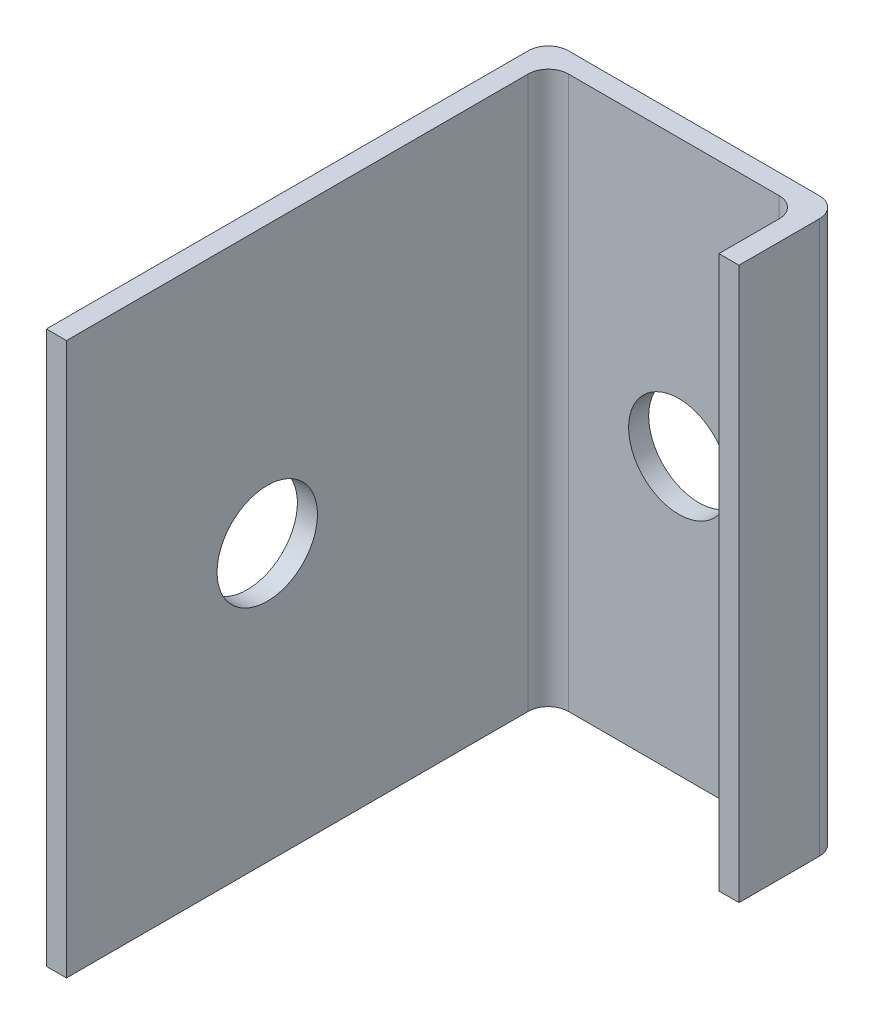
ISO-10303-21;
HEADER;
FILE_DESCRIPTION(('STEP AP214'),'2;1');
FILE_NAME('part.step','',(''),(''),'','','');
FILE_SCHEMA(('AUTOMOTIVE_DESIGN { 1 0 10303 214 1 1 1 1 }'));
ENDSEC;
DATA;
#1=APPLICATION_CONTEXT('core data for automotive mechanical design processes');
#2=APPLICATION_PROTOCOL_DEFINITION('international standard','automotive_design',2000,#1);
#3=PRODUCT_CONTEXT('',#1,'mechanical');
#4=PRODUCT('Part','Part','',(#3));
#5=PRODUCT_RELATED_PRODUCT_CATEGORY('part','',(#4));
#6=PRODUCT_DEFINITION_FORMATION('','',#4);
#7=PRODUCT_DEFINITION_CONTEXT('part definition',#1,'design');
#8=PRODUCT_DEFINITION('design','',#6,#7);
#9=PRODUCT_DEFINITION_SHAPE('','',#8);
#10=(LENGTH_UNIT() NAMED_UNIT(*) SI_UNIT(.MILLI.,.METRE.));
#11=(NAMED_UNIT(*) PLANE_ANGLE_UNIT() SI_UNIT($,.RADIAN.));
#12=(NAMED_UNIT(*) SI_UNIT($,.STERADIAN.) SOLID_ANGLE_UNIT());
#13=UNCERTAINTY_MEASURE_WITH_UNIT(LENGTH_MEASURE(1.E-05),#10,'distance_accuracy_value','');
#14=(GEOMETRIC_REPRESENTATION_CONTEXT(3) GLOBAL_UNCERTAINTY_ASSIGNED_CONTEXT((#13)) GLOBAL_UNIT_ASSIGNED_CONTEXT((#10,
#11,#12)) REPRESENTATION_CONTEXT('',''));
#15=CARTESIAN_POINT('',(0.,0.,0.));
#16=DIRECTION('',(0.,0.,1.));
#17=DIRECTION('',(1.,0.,0.));
#18=AXIS2_PLACEMENT_3D('',#15,#16,#17);
#19=CARTESIAN_POINT('',(-61.1613974505327,55.,27.487824391172));
#20=DIRECTION('',(0.,0.,-1.));
#21=DIRECTION('',(-1.,0.,0.));
#22=AXIS2_PLACEMENT_3D('',#19,#20,#21);
#23=PLANE('',#22);
#24=DIRECTION('',(1.,0.,0.));
#25=VECTOR('',#24,1.);
#26=CARTESIAN_POINT('',(-61.1613974505327,0.,27.487824391172));
#27=LINE('',#26,#25);
#28=CARTESIAN_POINT('',(-61.1613974505327,0.,27.487824391172));
#29=VERTEX_POINT('',#28);
#30=CARTESIAN_POINT('',(-59.1613974505327,0.,27.487824391172));
#31=VERTEX_POINT('',#30);
#32=EDGE_CURVE('E153',#29,#31,#27,.T.);
#33=ORIENTED_EDGE('',*,*,#32,.T.);
#34=DIRECTION('',(0.,-1.,0.));
#35=VECTOR('',#34,1.);
#36=CARTESIAN_POINT('',(-59.1613974505327,55.,27.487824391172));
#37=LINE('',#36,#35);
#38=CARTESIAN_POINT('',(-59.1613974505327,55.,27.487824391172));
#39=VERTEX_POINT('',#38);
#40=EDGE_CURVE('E11',#39,#31,#37,.T.);
#41=ORIENTED_EDGE('',*,*,#40,.F.);
#42=DIRECTION('',(1.,0.,0.));
#43=VECTOR('',#42,1.);
#44=CARTESIAN_POINT('',(-61.1613974505327,55.,27.487824391172));
#45=LINE('',#44,#43);
#46=CARTESIAN_POINT('',(-61.1613974505327,55.,27.487824391172));
#47=VERTEX_POINT('',#46);
#48=EDGE_CURVE('E176',#47,#39,#45,.T.);
#49=ORIENTED_EDGE('',*,*,#48,.F.);
#50=DIRECTION('',(0.,-1.,0.));
#51=VECTOR('',#50,1.);
#52=CARTESIAN_POINT('',(-61.1613974505327,55.,27.487824391172));
#53=LINE('',#52,#51);
#54=EDGE_CURVE('E149',#47,#29,#53,.T.);
#55=ORIENTED_EDGE('',*,*,#54,.T.);
#56=EDGE_LOOP('',(#33,#41,#49,#55));
#57=FACE_BOUND('',#56,.T.);
#58=ADVANCED_FACE('F33',(#57),#23,.F.);
#59=CARTESIAN_POINT('',(-59.1613974505327,55.,27.487824391172));
#60=DIRECTION('',(-1.,0.,0.));
#61=DIRECTION('',(0.,0.,1.));
#62=AXIS2_PLACEMENT_3D('',#59,#60,#61);
#63=PLANE('',#62);
#64=CARTESIAN_POINT('',(-59.1613974505327,27.5,7.48782439117199));
#65=DIRECTION('',(-1.,0.,0.));
#66=DIRECTION('',(0.,0.,1.));
#67=AXIS2_PLACEMENT_3D('',#64,#65,#66);
#68=CIRCLE('',#67,5.);
#69=CARTESIAN_POINT('',(-59.1613974505327,27.5,12.487824391172));
#70=VERTEX_POINT('',#69);
#71=EDGE_CURVE('E292',#70,#70,#68,.T.);
#72=ORIENTED_EDGE('',*,*,#71,.T.);
#73=EDGE_LOOP('',(#72));
#74=FACE_BOUND('',#73,.T.);
#75=DIRECTION('',(0.,0.,-1.));
#76=VECTOR('',#75,1.);
#77=CARTESIAN_POINT('',(-59.1613974505327,0.,27.487824391172));
#78=LINE('',#77,#76);
#79=CARTESIAN_POINT('',(-59.1613974505327,0.,-18.512175608828));
#80=VERTEX_POINT('',#79);
#81=EDGE_CURVE('E156',#31,#80,#78,.T.);
#82=ORIENTED_EDGE('',*,*,#81,.T.);
#83=DIRECTION('',(0.,-1.,0.));
#84=VECTOR('',#83,1.);
#85=CARTESIAN_POINT('',(-59.1613974505327,55.,-18.512175608828));
#86=LINE('',#85,#84);
#87=CARTESIAN_POINT('',(-59.1613974505327,55.,-18.512175608828));
#88=VERTEX_POINT('',#87);
#89=EDGE_CURVE('E41',#88,#80,#86,.T.);
#90=ORIENTED_EDGE('',*,*,#89,.F.);
#91=DIRECTION('',(0.,0.,-1.));
#92=VECTOR('',#91,1.);
#93=CARTESIAN_POINT('',(-59.1613974505327,55.,27.487824391172));
#94=LINE('',#93,#92);
#95=EDGE_CURVE('E104',#39,#88,#94,.T.);
#96=ORIENTED_EDGE('',*,*,#95,.F.);
#97=ORIENTED_EDGE('',*,*,#40,.T.);
#98=EDGE_LOOP('',(#82,#90,#96,#97));
#99=FACE_BOUND('',#98,.T.);
#100=ADVANCED_FACE('F256',(#74,#99),#63,.F.);
#101=CARTESIAN_POINT('',(-57.1613974505327,55.,-18.512175608828));
#102=DIRECTION('',(0.,-1.,0.));
#103=DIRECTION('',(0.,0.,-1.));
#104=AXIS2_PLACEMENT_3D('',#101,#102,#103);
#105=CYLINDRICAL_SURFACE('',#104,2.);
#106=CARTESIAN_POINT('',(-57.1613974505327,0.,-18.512175608828));
#107=DIRECTION('',(0.,-1.,0.));
#108=DIRECTION('',(0.,0.,1.));
#109=AXIS2_PLACEMENT_3D('',#106,#107,#108);
#110=CIRCLE('',#109,2.);
#111=CARTESIAN_POINT('',(-57.1613974505327,0.,-20.512175608828));
#112=VERTEX_POINT('',#111);
#113=EDGE_CURVE('E159',#80,#112,#110,.T.);
#114=ORIENTED_EDGE('',*,*,#113,.T.);
#115=DIRECTION('',(0.,-1.,0.));
#116=VECTOR('',#115,1.);
#117=CARTESIAN_POINT('',(-57.1613974505327,55.,-20.512175608828));
#118=LINE('',#117,#116);
#119=CARTESIAN_POINT('',(-57.1613974505327,55.,-20.512175608828));
#120=VERTEX_POINT('',#119);
#121=EDGE_CURVE('E195',#120,#112,#118,.T.);
#122=ORIENTED_EDGE('',*,*,#121,.F.);
#123=CARTESIAN_POINT('',(-57.1613974505327,55.,-18.512175608828));
#124=DIRECTION('',(0.,-1.,0.));
#125=DIRECTION('',(0.,0.,1.));
#126=AXIS2_PLACEMENT_3D('',#123,#124,#125);
#127=CIRCLE('',#126,2.);
#128=EDGE_CURVE('E203',#88,#120,#127,.T.);
#129=ORIENTED_EDGE('',*,*,#128,.F.);
#130=ORIENTED_EDGE('',*,*,#89,.T.);
#131=EDGE_LOOP('',(#114,#122,#129,#130));
#132=FACE_BOUND('',#131,.T.);
#133=ADVANCED_FACE('F201',(#132),#105,.F.);
#134=CARTESIAN_POINT('',(-57.1613974505327,55.,-20.512175608828));
#135=DIRECTION('',(0.,0.,-1.));
#136=DIRECTION('',(-1.,0.,0.));
#137=AXIS2_PLACEMENT_3D('',#134,#135,#136);
#138=PLANE('',#137);
#139=CARTESIAN_POINT('',(-46.1613974505327,27.5,-20.512175608828));
#140=DIRECTION('',(0.,0.,-1.));
#141=DIRECTION('',(-1.,0.,0.));
#142=AXIS2_PLACEMENT_3D('',#139,#140,#141);
#143=CIRCLE('',#142,4.99999999999999);
#144=CARTESIAN_POINT('',(-51.1613974505327,27.5,-20.512175608828));
#145=VERTEX_POINT('',#144);
#146=EDGE_CURVE('E157',#145,#145,#143,.T.);
#147=ORIENTED_EDGE('',*,*,#146,.T.);
#148=EDGE_LOOP('',(#147));
#149=FACE_BOUND('',#148,.T.);
#150=DIRECTION('',(1.,0.,0.));
#151=VECTOR('',#150,1.);
#152=CARTESIAN_POINT('',(-57.1613974505327,0.,-20.512175608828));
#153=LINE('',#152,#151);
#154=CARTESIAN_POINT('',(-36.1613974505327,0.,-20.512175608828));
#155=VERTEX_POINT('',#154);
#156=EDGE_CURVE('E161',#112,#155,#153,.T.);
#157=ORIENTED_EDGE('',*,*,#156,.T.);
#158=DIRECTION('',(0.,-1.,0.));
#159=VECTOR('',#158,1.);
#160=CARTESIAN_POINT('',(-36.1613974505327,55.,-20.512175608828));
#161=LINE('',#160,#159);
#162=CARTESIAN_POINT('',(-36.1613974505327,55.,-20.512175608828));
#163=VERTEX_POINT('',#162);
#164=EDGE_CURVE('E192',#163,#155,#161,.T.);
#165=ORIENTED_EDGE('',*,*,#164,.F.);
#166=DIRECTION('',(1.,0.,0.));
#167=VECTOR('',#166,1.);
#168=CARTESIAN_POINT('',(-57.1613974505327,55.,-20.512175608828));
#169=LINE('',#168,#167);
#170=EDGE_CURVE('E221',#120,#163,#169,.T.);
#171=ORIENTED_EDGE('',*,*,#170,.F.);
#172=ORIENTED_EDGE('',*,*,#121,.T.);
#173=EDGE_LOOP('',(#157,#165,#171,#172));
#174=FACE_BOUND('',#173,.T.);
#175=ADVANCED_FACE('F212',(#149,#174),#138,.F.);
#176=CARTESIAN_POINT('',(-36.1613974505327,55.,-18.512175608828));
#177=DIRECTION('',(0.,-1.,0.));
#178=DIRECTION('',(0.,0.,-1.));
#179=AXIS2_PLACEMENT_3D('',#176,#177,#178);
#180=CYLINDRICAL_SURFACE('',#179,2.);
#181=CARTESIAN_POINT('',(-36.1613974505327,0.,-18.512175608828));
#182=DIRECTION('',(0.,-1.,0.));
#183=DIRECTION('',(0.,0.,-1.));
#184=AXIS2_PLACEMENT_3D('',#181,#182,#183);
#185=CIRCLE('',#184,2.);
#186=CARTESIAN_POINT('',(-34.1613974505327,0.,-18.512175608828));
#187=VERTEX_POINT('',#186);
#188=EDGE_CURVE('E163',#155,#187,#185,.T.);
#189=ORIENTED_EDGE('',*,*,#188,.T.);
#190=DIRECTION('',(0.,-1.,0.));
#191=VECTOR('',#190,1.);
#192=CARTESIAN_POINT('',(-34.1613974505327,55.,-18.512175608828));
#193=LINE('',#192,#191);
#194=CARTESIAN_POINT('',(-34.1613974505327,55.,-18.512175608828));
#195=VERTEX_POINT('',#194);
#196=EDGE_CURVE('E189',#195,#187,#193,.T.);
#197=ORIENTED_EDGE('',*,*,#196,.F.);
#198=CARTESIAN_POINT('',(-36.1613974505327,55.,-18.512175608828));
#199=DIRECTION('',(0.,-1.,0.));
#200=DIRECTION('',(0.,0.,-1.));
#201=AXIS2_PLACEMENT_3D('',#198,#199,#200);
#202=CIRCLE('',#201,2.);
#203=EDGE_CURVE('E218',#163,#195,#202,.T.);
#204=ORIENTED_EDGE('',*,*,#203,.F.);
#205=ORIENTED_EDGE('',*,*,#164,.T.);
#206=EDGE_LOOP('',(#189,#197,#204,#205));
#207=FACE_BOUND('',#206,.T.);
#208=ADVANCED_FACE('F216',(#207),#180,.F.);
#209=CARTESIAN_POINT('',(-34.1613974505327,55.,-18.512175608828));
#210=DIRECTION('',(1.,0.,0.));
#211=DIRECTION('',(0.,0.,-1.));
#212=AXIS2_PLACEMENT_3D('',#209,#210,#211);
#213=PLANE('',#212);
#214=DIRECTION('',(0.,0.,1.));
#215=VECTOR('',#214,1.);
#216=CARTESIAN_POINT('',(-34.1613974505327,0.,-18.512175608828));
#217=LINE('',#216,#215);
#218=CARTESIAN_POINT('',(-34.1613974505327,0.,-12.512175608828));
#219=VERTEX_POINT('',#218);
#220=EDGE_CURVE('E165',#187,#219,#217,.T.);
#221=ORIENTED_EDGE('',*,*,#220,.T.);
#222=DIRECTION('',(0.,-1.,0.));
#223=VECTOR('',#222,1.);
#224=CARTESIAN_POINT('',(-34.1613974505327,55.,-12.512175608828));
#225=LINE('',#224,#223);
#226=CARTESIAN_POINT('',(-34.1613974505327,55.,-12.512175608828));
#227=VERTEX_POINT('',#226);
#228=EDGE_CURVE('E186',#227,#219,#225,.T.);
#229=ORIENTED_EDGE('',*,*,#228,.F.);
#230=DIRECTION('',(0.,0.,1.));
#231=VECTOR('',#230,1.);
#232=CARTESIAN_POINT('',(-34.1613974505327,55.,-18.512175608828));
#233=LINE('',#232,#231);
#234=EDGE_CURVE('E220',#195,#227,#233,.T.);
#235=ORIENTED_EDGE('',*,*,#234,.F.);
#236=ORIENTED_EDGE('',*,*,#196,.T.);
#237=EDGE_LOOP('',(#221,#229,#235,#236));
#238=FACE_BOUND('',#237,.T.);
#239=ADVANCED_FACE('F272',(#238),#213,.F.);
#240=CARTESIAN_POINT('',(-34.1613974505327,55.,-12.512175608828));
#241=DIRECTION('',(0.,0.,-1.));
#242=DIRECTION('',(-1.,0.,0.));
#243=AXIS2_PLACEMENT_3D('',#240,#241,#242);
#244=PLANE('',#243);
#245=DIRECTION('',(1.,0.,0.));
#246=VECTOR('',#245,1.);
#247=CARTESIAN_POINT('',(-34.1613974505327,0.,-12.512175608828));
#248=LINE('',#247,#246);
#249=CARTESIAN_POINT('',(-32.1613974505327,0.,-12.512175608828));
#250=VERTEX_POINT('',#249);
#251=EDGE_CURVE('E167',#219,#250,#248,.T.);
#252=ORIENTED_EDGE('',*,*,#251,.T.);
#253=DIRECTION('',(0.,-1.,0.));
#254=VECTOR('',#253,1.);
#255=CARTESIAN_POINT('',(-32.1613974505327,55.,-12.512175608828));
#256=LINE('',#255,#254);
#257=CARTESIAN_POINT('',(-32.1613974505327,55.,-12.512175608828));
#258=VERTEX_POINT('',#257);
#259=EDGE_CURVE('E183',#258,#250,#256,.T.);
#260=ORIENTED_EDGE('',*,*,#259,.F.);
#261=DIRECTION('',(1.,0.,0.));
#262=VECTOR('',#261,1.);
#263=CARTESIAN_POINT('',(-34.1613974505327,55.,-12.512175608828));
#264=LINE('',#263,#262);
#265=EDGE_CURVE('E223',#227,#258,#264,.T.);
#266=ORIENTED_EDGE('',*,*,#265,.F.);
#267=ORIENTED_EDGE('',*,*,#228,.T.);
#268=EDGE_LOOP('',(#252,#260,#266,#267));
#269=FACE_BOUND('',#268,.T.);
#270=ADVANCED_FACE('F275',(#269),#244,.F.);
#271=CARTESIAN_POINT('',(-32.1613974505327,55.,-20.512175608828));
#272=DIRECTION('',(-1.,0.,0.));
#273=DIRECTION('',(0.,0.,1.));
#274=AXIS2_PLACEMENT_3D('',#271,#272,#273);
#275=PLANE('',#274);
#276=DIRECTION('',(0.,0.,-1.));
#277=VECTOR('',#276,1.);
#278=CARTESIAN_POINT('',(-32.1613974505327,0.,-20.512175608828));
#279=LINE('',#278,#277);
#280=CARTESIAN_POINT('',(-32.1613974505327,0.,-20.512175608828));
#281=VERTEX_POINT('',#280);
#282=EDGE_CURVE('E169',#250,#281,#279,.T.);
#283=ORIENTED_EDGE('',*,*,#282,.T.);
#284=DIRECTION('',(0.,-1.,0.));
#285=VECTOR('',#284,1.);
#286=CARTESIAN_POINT('',(-32.1613974505327,55.,-20.512175608828));
#287=LINE('',#286,#285);
#288=CARTESIAN_POINT('',(-32.1613974505327,55.,-20.512175608828));
#289=VERTEX_POINT('',#288);
#290=EDGE_CURVE('E180',#289,#281,#287,.T.);
#291=ORIENTED_EDGE('',*,*,#290,.F.);
#292=DIRECTION('',(0.,0.,-1.));
#293=VECTOR('',#292,1.);
#294=CARTESIAN_POINT('',(-32.1613974505327,55.,-20.512175608828));
#295=LINE('',#294,#293);
#296=EDGE_CURVE('E229',#258,#289,#295,.T.);
#297=ORIENTED_EDGE('',*,*,#296,.F.);
#298=ORIENTED_EDGE('',*,*,#259,.T.);
#299=EDGE_LOOP('',(#283,#291,#297,#298));
#300=FACE_BOUND('',#299,.T.);
#301=ADVANCED_FACE('F235',(#300),#275,.F.);
#302=CARTESIAN_POINT('',(-34.1613974505327,55.,-20.512175608828));
#303=DIRECTION('',(0.,-1.,0.));
#304=DIRECTION('',(0.,0.,-1.));
#305=AXIS2_PLACEMENT_3D('',#302,#303,#304);
#306=CYLINDRICAL_SURFACE('',#305,2.);
#307=CARTESIAN_POINT('',(-34.1613974505327,0.,-20.512175608828));
#308=DIRECTION('',(0.,1.,0.));
#309=DIRECTION('',(0.,0.,1.));
#310=AXIS2_PLACEMENT_3D('',#307,#308,#309);
#311=CIRCLE('',#310,2.);
#312=CARTESIAN_POINT('',(-34.1613974505327,0.,-22.512175608828));
#313=VERTEX_POINT('',#312);
#314=EDGE_CURVE('E171',#281,#313,#311,.T.);
#315=ORIENTED_EDGE('',*,*,#314,.T.);
#316=DIRECTION('',(0.,-1.,0.));
#317=VECTOR('',#316,1.);
#318=CARTESIAN_POINT('',(-34.1613974505327,55.,-22.512175608828));
#319=LINE('',#318,#317);
#320=CARTESIAN_POINT('',(-34.1613974505327,55.,-22.512175608828));
#321=VERTEX_POINT('',#320);
#322=EDGE_CURVE('E144',#321,#313,#319,.T.);
#323=ORIENTED_EDGE('',*,*,#322,.F.);
#324=CARTESIAN_POINT('',(-34.1613974505327,55.,-20.512175608828));
#325=DIRECTION('',(0.,1.,0.));
#326=DIRECTION('',(0.,0.,1.));
#327=AXIS2_PLACEMENT_3D('',#324,#325,#326);
#328=CIRCLE('',#327,2.);
#329=EDGE_CURVE('E135',#289,#321,#328,.T.);
#330=ORIENTED_EDGE('',*,*,#329,.F.);
#331=ORIENTED_EDGE('',*,*,#290,.T.);
#332=EDGE_LOOP('',(#315,#323,#330,#331));
#333=FACE_BOUND('',#332,.T.);
#334=ADVANCED_FACE('F239',(#333),#306,.T.);
#335=CARTESIAN_POINT('',(-59.1613974505327,55.,-22.512175608828));
#336=DIRECTION('',(0.,0.,1.));
#337=DIRECTION('',(1.,0.,0.));
#338=AXIS2_PLACEMENT_3D('',#335,#336,#337);
#339=PLANE('',#338);
#340=CARTESIAN_POINT('',(-46.1613974505327,27.5,-22.512175608828));
#341=DIRECTION('',(0.,0.,-1.));
#342=DIRECTION('',(-1.,0.,0.));
#343=AXIS2_PLACEMENT_3D('',#340,#341,#342);
#344=CIRCLE('',#343,5.);
#345=CARTESIAN_POINT('',(-51.1613974505327,27.5,-22.512175608828));
#346=VERTEX_POINT('',#345);
#347=EDGE_CURVE('E290',#346,#346,#344,.T.);
#348=ORIENTED_EDGE('',*,*,#347,.F.);
#349=EDGE_LOOP('',(#348));
#350=FACE_BOUND('',#349,.T.);
#351=DIRECTION('',(-1.,0.,0.));
#352=VECTOR('',#351,1.);
#353=CARTESIAN_POINT('',(-59.1613974505327,0.,-22.512175608828));
#354=LINE('',#353,#352);
#355=CARTESIAN_POINT('',(-59.1613974505327,0.,-22.512175608828));
#356=VERTEX_POINT('',#355);
#357=EDGE_CURVE('E143',#313,#356,#354,.T.);
#358=ORIENTED_EDGE('',*,*,#357,.T.);
#359=DIRECTION('',(0.,-1.,0.));
#360=VECTOR('',#359,1.);
#361=CARTESIAN_POINT('',(-59.1613974505327,55.,-22.512175608828));
#362=LINE('',#361,#360);
#363=CARTESIAN_POINT('',(-59.1613974505327,55.,-22.512175608828));
#364=VERTEX_POINT('',#363);
#365=EDGE_CURVE('E140',#364,#356,#362,.T.);
#366=ORIENTED_EDGE('',*,*,#365,.F.);
#367=DIRECTION('',(-1.,0.,0.));
#368=VECTOR('',#367,1.);
#369=CARTESIAN_POINT('',(-59.1613974505327,55.,-22.512175608828));
#370=LINE('',#369,#368);
#371=EDGE_CURVE('E129',#321,#364,#370,.T.);
#372=ORIENTED_EDGE('',*,*,#371,.F.);
#373=ORIENTED_EDGE('',*,*,#322,.T.);
#374=EDGE_LOOP('',(#358,#366,#372,#373));
#375=FACE_BOUND('',#374,.T.);
#376=ADVANCED_FACE('F141',(#350,#375),#339,.F.);
#377=CARTESIAN_POINT('',(-59.1613974505327,55.,-20.512175608828));
#378=DIRECTION('',(0.,-1.,0.));
#379=DIRECTION('',(0.,0.,-1.));
#380=AXIS2_PLACEMENT_3D('',#377,#378,#379);
#381=CYLINDRICAL_SURFACE('',#380,2.);
#382=CARTESIAN_POINT('',(-59.1613974505327,0.,-20.512175608828));
#383=DIRECTION('',(0.,1.,0.));
#384=DIRECTION('',(0.,0.,1.));
#385=AXIS2_PLACEMENT_3D('',#382,#383,#384);
#386=CIRCLE('',#385,2.);
#387=CARTESIAN_POINT('',(-61.1613974505327,0.,-20.512175608828));
#388=VERTEX_POINT('',#387);
#389=EDGE_CURVE('E90',#356,#388,#386,.T.);
#390=ORIENTED_EDGE('',*,*,#389,.T.);
#391=DIRECTION('',(0.,-1.,0.));
#392=VECTOR('',#391,1.);
#393=CARTESIAN_POINT('',(-61.1613974505327,55.,-20.512175608828));
#394=LINE('',#393,#392);
#395=CARTESIAN_POINT('',(-61.1613974505327,55.,-20.512175608828));
#396=VERTEX_POINT('',#395);
#397=EDGE_CURVE('E145',#396,#388,#394,.T.);
#398=ORIENTED_EDGE('',*,*,#397,.F.);
#399=CARTESIAN_POINT('',(-59.1613974505327,55.,-20.512175608828));
#400=DIRECTION('',(0.,1.,0.));
#401=DIRECTION('',(0.,0.,1.));
#402=AXIS2_PLACEMENT_3D('',#399,#400,#401);
#403=CIRCLE('',#402,2.);
#404=EDGE_CURVE('E133',#364,#396,#403,.T.);
#405=ORIENTED_EDGE('',*,*,#404,.F.);
#406=ORIENTED_EDGE('',*,*,#365,.T.);
#407=EDGE_LOOP('',(#390,#398,#405,#406));
#408=FACE_BOUND('',#407,.T.);
#409=ADVANCED_FACE('F147',(#408),#381,.T.);
#410=CARTESIAN_POINT('',(-61.1613974505327,55.,27.487824391172));
#411=DIRECTION('',(1.,0.,0.));
#412=DIRECTION('',(0.,0.,-1.));
#413=AXIS2_PLACEMENT_3D('',#410,#411,#412);
#414=PLANE('',#413);
#415=CARTESIAN_POINT('',(-61.1613974505327,27.5,7.48782439117199));
#416=DIRECTION('',(-1.,0.,0.));
#417=DIRECTION('',(0.,0.,1.));
#418=AXIS2_PLACEMENT_3D('',#415,#416,#417);
#419=CIRCLE('',#418,5.);
#420=CARTESIAN_POINT('',(-61.1613974505327,27.5,12.487824391172));
#421=VERTEX_POINT('',#420);
#422=EDGE_CURVE('E296',#421,#421,#419,.T.);
#423=ORIENTED_EDGE('',*,*,#422,.F.);
#424=EDGE_LOOP('',(#423));
#425=FACE_BOUND('',#424,.T.);
#426=DIRECTION('',(0.,0.,1.));
#427=VECTOR('',#426,1.);
#428=CARTESIAN_POINT('',(-61.1613974505327,0.,27.487824391172));
#429=LINE('',#428,#427);
#430=EDGE_CURVE('E96',#388,#29,#429,.T.);
#431=ORIENTED_EDGE('',*,*,#430,.T.);
#432=ORIENTED_EDGE('',*,*,#54,.F.);
#433=DIRECTION('',(0.,0.,1.));
#434=VECTOR('',#433,1.);
#435=CARTESIAN_POINT('',(-61.1613974505327,55.,27.487824391172));
#436=LINE('',#435,#434);
#437=EDGE_CURVE('E49',#396,#47,#436,.T.);
#438=ORIENTED_EDGE('',*,*,#437,.F.);
#439=ORIENTED_EDGE('',*,*,#397,.T.);
#440=EDGE_LOOP('',(#431,#432,#438,#439));
#441=FACE_BOUND('',#440,.T.);
#442=ADVANCED_FACE('F243',(#425,#441),#414,.F.);
#443=CARTESIAN_POINT('',(-57.1613974505327,55.,-18.512175608828));
#444=DIRECTION('',(0.,1.,0.));
#445=DIRECTION('',(0.,0.,1.));
#446=AXIS2_PLACEMENT_3D('',#443,#444,#445);
#447=PLANE('',#446);
#448=ORIENTED_EDGE('',*,*,#48,.T.);
#449=ORIENTED_EDGE('',*,*,#95,.T.);
#450=ORIENTED_EDGE('',*,*,#128,.T.);
#451=ORIENTED_EDGE('',*,*,#170,.T.);
#452=ORIENTED_EDGE('',*,*,#203,.T.);
#453=ORIENTED_EDGE('',*,*,#234,.T.);
#454=ORIENTED_EDGE('',*,*,#265,.T.);
#455=ORIENTED_EDGE('',*,*,#296,.T.);
#456=ORIENTED_EDGE('',*,*,#329,.T.);
#457=ORIENTED_EDGE('',*,*,#371,.T.);
#458=ORIENTED_EDGE('',*,*,#404,.T.);
#459=ORIENTED_EDGE('',*,*,#437,.T.);
#460=EDGE_LOOP('',(#448,#449,#450,#451,#452,#453,#454,#455,#456,#457,#458,#459));
#461=FACE_BOUND('',#460,.T.);
#462=ADVANCED_FACE('F131',(#461),#447,.T.);
#463=CARTESIAN_POINT('',(-57.1613974505327,0.,-18.512175608828));
#464=DIRECTION('',(0.,1.,0.));
#465=DIRECTION('',(0.,0.,1.));
#466=AXIS2_PLACEMENT_3D('',#463,#464,#465);
#467=PLANE('',#466);
#468=ORIENTED_EDGE('',*,*,#32,.F.);
#469=ORIENTED_EDGE('',*,*,#430,.F.);
#470=ORIENTED_EDGE('',*,*,#389,.F.);
#471=ORIENTED_EDGE('',*,*,#357,.F.);
#472=ORIENTED_EDGE('',*,*,#314,.F.);
#473=ORIENTED_EDGE('',*,*,#282,.F.);
#474=ORIENTED_EDGE('',*,*,#251,.F.);
#475=ORIENTED_EDGE('',*,*,#220,.F.);
#476=ORIENTED_EDGE('',*,*,#188,.F.);
#477=ORIENTED_EDGE('',*,*,#156,.F.);
#478=ORIENTED_EDGE('',*,*,#113,.F.);
#479=ORIENTED_EDGE('',*,*,#81,.F.);
#480=EDGE_LOOP('',(#468,#469,#470,#471,#472,#473,#474,#475,#476,#477,#478,#479));
#481=FACE_BOUND('',#480,.T.);
#482=ADVANCED_FACE('F207',(#481),#467,.F.);
#483=CARTESIAN_POINT('',(-46.1613974505327,27.5,-22.512175608828));
#484=DIRECTION('',(0.,0.,-1.));
#485=DIRECTION('',(-1.,0.,0.));
#486=AXIS2_PLACEMENT_3D('',#483,#484,#485);
#487=CYLINDRICAL_SURFACE('',#486,4.99999999999999);
#488=ORIENTED_EDGE('',*,*,#347,.T.);
#489=EDGE_LOOP('',(#488));
#490=FACE_BOUND('',#489,.T.);
#491=ORIENTED_EDGE('',*,*,#146,.F.);
#492=EDGE_LOOP('',(#491));
#493=FACE_BOUND('',#492,.T.);
#494=ADVANCED_FACE('F306',(#490,#493),#487,.F.);
#495=CARTESIAN_POINT('',(-61.1613974505327,27.5,7.48782439117199));
#496=DIRECTION('',(-1.,0.,0.));
#497=DIRECTION('',(0.,0.,1.));
#498=AXIS2_PLACEMENT_3D('',#495,#496,#497);
#499=CYLINDRICAL_SURFACE('',#498,5.);
#500=ORIENTED_EDGE('',*,*,#422,.T.);
#501=EDGE_LOOP('',(#500));
#502=FACE_BOUND('',#501,.T.);
#503=ORIENTED_EDGE('',*,*,#71,.F.);
#504=EDGE_LOOP('',(#503));
#505=FACE_BOUND('',#504,.T.);
#506=ADVANCED_FACE('F303',(#502,#505),#499,.F.);
#507=CLOSED_SHELL('',(#58,#100,#133,#175,#208,#239,#270,#301,#334,#376,#409,#442,#462,#482,#494,#506));
#508=MANIFOLD_SOLID_BREP('B2',#507);
#509=ADVANCED_BREP_SHAPE_REPRESENTATION('',(#18,#508),#14);
#510=SHAPE_DEFINITION_REPRESENTATION(#9,#509);
ENDSEC;
END-ISO-10303-21;
